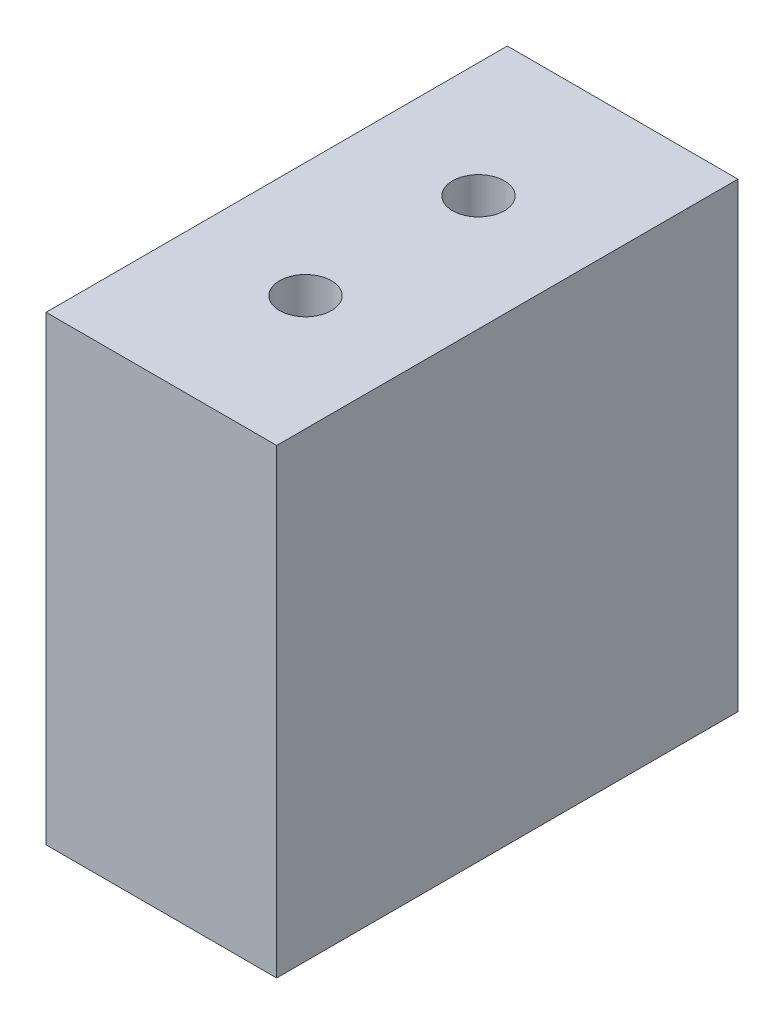
ISO-10303-21;
HEADER;
FILE_DESCRIPTION(('STEP AP214'),'2;1');
FILE_NAME('part.step','',(''),(''),'','','');
FILE_SCHEMA(('AUTOMOTIVE_DESIGN { 1 0 10303 214 1 1 1 1 }'));
ENDSEC;
DATA;
#1=APPLICATION_CONTEXT('core data for automotive mechanical design processes');
#2=APPLICATION_PROTOCOL_DEFINITION('international standard','automotive_design',2000,#1);
#3=PRODUCT_CONTEXT('',#1,'mechanical');
#4=PRODUCT('Part','Part','',(#3));
#5=PRODUCT_RELATED_PRODUCT_CATEGORY('part','',(#4));
#6=PRODUCT_DEFINITION_FORMATION('','',#4);
#7=PRODUCT_DEFINITION_CONTEXT('part definition',#1,'design');
#8=PRODUCT_DEFINITION('design','',#6,#7);
#9=PRODUCT_DEFINITION_SHAPE('','',#8);
#10=(LENGTH_UNIT() NAMED_UNIT(*) SI_UNIT(.MILLI.,.METRE.));
#11=(NAMED_UNIT(*) PLANE_ANGLE_UNIT() SI_UNIT($,.RADIAN.));
#12=(NAMED_UNIT(*) SI_UNIT($,.STERADIAN.) SOLID_ANGLE_UNIT());
#13=UNCERTAINTY_MEASURE_WITH_UNIT(LENGTH_MEASURE(1.E-05),#10,'distance_accuracy_value','');
#14=(GEOMETRIC_REPRESENTATION_CONTEXT(3) GLOBAL_UNCERTAINTY_ASSIGNED_CONTEXT((#13)) GLOBAL_UNIT_ASSIGNED_CONTEXT((#10,
#11,#12)) REPRESENTATION_CONTEXT('',''));
#15=CARTESIAN_POINT('',(0.,0.,0.));
#16=DIRECTION('',(0.,0.,1.));
#17=DIRECTION('',(1.,0.,0.));
#18=AXIS2_PLACEMENT_3D('',#15,#16,#17);
#19=CARTESIAN_POINT('',(20.,0.,0.));
#20=DIRECTION('',(0.,0.,1.));
#21=DIRECTION('',(1.,0.,0.));
#22=AXIS2_PLACEMENT_3D('',#19,#20,#21);
#23=PLANE('',#22);
#24=DIRECTION('',(0.,1.,0.));
#25=VECTOR('',#24,1.);
#26=CARTESIAN_POINT('',(0.,0.,0.));
#27=LINE('',#26,#25);
#28=CARTESIAN_POINT('',(0.,0.,0.));
#29=VERTEX_POINT('',#28);
#30=CARTESIAN_POINT('',(0.,40.,0.));
#31=VERTEX_POINT('',#30);
#32=EDGE_CURVE('E115',#29,#31,#27,.T.);
#33=ORIENTED_EDGE('',*,*,#32,.F.);
#34=DIRECTION('',(-1.,0.,0.));
#35=VECTOR('',#34,1.);
#36=CARTESIAN_POINT('',(20.,0.,0.));
#37=LINE('',#36,#35);
#38=CARTESIAN_POINT('',(20.,0.,0.));
#39=VERTEX_POINT('',#38);
#40=EDGE_CURVE('E11',#39,#29,#37,.T.);
#41=ORIENTED_EDGE('',*,*,#40,.F.);
#42=DIRECTION('',(0.,1.,0.));
#43=VECTOR('',#42,1.);
#44=CARTESIAN_POINT('',(20.,0.,0.));
#45=LINE('',#44,#43);
#46=CARTESIAN_POINT('',(20.,40.,0.));
#47=VERTEX_POINT('',#46);
#48=EDGE_CURVE('E107',#39,#47,#45,.T.);
#49=ORIENTED_EDGE('',*,*,#48,.T.);
#50=DIRECTION('',(-1.,0.,0.));
#51=VECTOR('',#50,1.);
#52=CARTESIAN_POINT('',(20.,40.,0.));
#53=LINE('',#52,#51);
#54=EDGE_CURVE('E46',#47,#31,#53,.T.);
#55=ORIENTED_EDGE('',*,*,#54,.T.);
#56=EDGE_LOOP('',(#33,#41,#49,#55));
#57=FACE_BOUND('',#56,.T.);
#58=ADVANCED_FACE('F43',(#57),#23,.T.);
#59=CARTESIAN_POINT('',(20.,0.,0.));
#60=DIRECTION('',(0.,1.,0.));
#61=DIRECTION('',(0.,0.,1.));
#62=AXIS2_PLACEMENT_3D('',#59,#60,#61);
#63=PLANE('',#62);
#64=CARTESIAN_POINT('',(10.,0.,-27.5));
#65=DIRECTION('',(0.,1.,0.));
#66=DIRECTION('',(0.,0.,1.));
#67=AXIS2_PLACEMENT_3D('',#64,#65,#66);
#68=CIRCLE('',#67,2.25);
#69=CARTESIAN_POINT('',(10.,0.,-25.25));
#70=VERTEX_POINT('',#69);
#71=EDGE_CURVE('E120',#70,#70,#68,.T.);
#72=ORIENTED_EDGE('',*,*,#71,.T.);
#73=EDGE_LOOP('',(#72));
#74=FACE_BOUND('',#73,.T.);
#75=CARTESIAN_POINT('',(10.,0.,-12.5));
#76=DIRECTION('',(0.,1.,0.));
#77=DIRECTION('',(0.,0.,1.));
#78=AXIS2_PLACEMENT_3D('',#75,#76,#77);
#79=CIRCLE('',#78,2.25);
#80=CARTESIAN_POINT('',(10.,0.,-10.25));
#81=VERTEX_POINT('',#80);
#82=EDGE_CURVE('E160',#81,#81,#79,.T.);
#83=ORIENTED_EDGE('',*,*,#82,.T.);
#84=EDGE_LOOP('',(#83));
#85=FACE_BOUND('',#84,.T.);
#86=DIRECTION('',(0.,0.,-1.));
#87=VECTOR('',#86,1.);
#88=CARTESIAN_POINT('',(0.,0.,0.));
#89=LINE('',#88,#87);
#90=CARTESIAN_POINT('',(0.,0.,-40.));
#91=VERTEX_POINT('',#90);
#92=EDGE_CURVE('E77',#29,#91,#89,.T.);
#93=ORIENTED_EDGE('',*,*,#92,.T.);
#94=DIRECTION('',(-1.,0.,0.));
#95=VECTOR('',#94,1.);
#96=CARTESIAN_POINT('',(20.,0.,-40.));
#97=LINE('',#96,#95);
#98=CARTESIAN_POINT('',(20.,0.,-40.));
#99=VERTEX_POINT('',#98);
#100=EDGE_CURVE('E53',#99,#91,#97,.T.);
#101=ORIENTED_EDGE('',*,*,#100,.F.);
#102=DIRECTION('',(0.,0.,-1.));
#103=VECTOR('',#102,1.);
#104=CARTESIAN_POINT('',(20.,0.,0.));
#105=LINE('',#104,#103);
#106=EDGE_CURVE('E94',#39,#99,#105,.T.);
#107=ORIENTED_EDGE('',*,*,#106,.F.);
#108=ORIENTED_EDGE('',*,*,#40,.T.);
#109=EDGE_LOOP('',(#93,#101,#107,#108));
#110=FACE_BOUND('',#109,.T.);
#111=ADVANCED_FACE('F132',(#74,#85,#110),#63,.F.);
#112=CARTESIAN_POINT('',(20.,0.,-40.));
#113=DIRECTION('',(0.,0.,1.));
#114=DIRECTION('',(1.,0.,0.));
#115=AXIS2_PLACEMENT_3D('',#112,#113,#114);
#116=PLANE('',#115);
#117=DIRECTION('',(0.,1.,0.));
#118=VECTOR('',#117,1.);
#119=CARTESIAN_POINT('',(0.,0.,-40.));
#120=LINE('',#119,#118);
#121=CARTESIAN_POINT('',(0.,40.,-40.));
#122=VERTEX_POINT('',#121);
#123=EDGE_CURVE('E102',#91,#122,#120,.T.);
#124=ORIENTED_EDGE('',*,*,#123,.T.);
#125=DIRECTION('',(-1.,0.,0.));
#126=VECTOR('',#125,1.);
#127=CARTESIAN_POINT('',(20.,40.,-40.));
#128=LINE('',#127,#126);
#129=CARTESIAN_POINT('',(20.,40.,-40.));
#130=VERTEX_POINT('',#129);
#131=EDGE_CURVE('E99',#130,#122,#128,.T.);
#132=ORIENTED_EDGE('',*,*,#131,.F.);
#133=DIRECTION('',(0.,1.,0.));
#134=VECTOR('',#133,1.);
#135=CARTESIAN_POINT('',(20.,0.,-40.));
#136=LINE('',#135,#134);
#137=EDGE_CURVE('E89',#99,#130,#136,.T.);
#138=ORIENTED_EDGE('',*,*,#137,.F.);
#139=ORIENTED_EDGE('',*,*,#100,.T.);
#140=EDGE_LOOP('',(#124,#132,#138,#139));
#141=FACE_BOUND('',#140,.T.);
#142=ADVANCED_FACE('F100',(#141),#116,.F.);
#143=CARTESIAN_POINT('',(20.,40.,0.));
#144=DIRECTION('',(0.,1.,0.));
#145=DIRECTION('',(0.,0.,1.));
#146=AXIS2_PLACEMENT_3D('',#143,#144,#145);
#147=PLANE('',#146);
#148=CARTESIAN_POINT('',(10.,40.,-27.5));
#149=DIRECTION('',(0.,1.,0.));
#150=DIRECTION('',(0.,0.,1.));
#151=AXIS2_PLACEMENT_3D('',#148,#149,#150);
#152=CIRCLE('',#151,2.25);
#153=CARTESIAN_POINT('',(10.,40.,-25.25));
#154=VERTEX_POINT('',#153);
#155=EDGE_CURVE('E154',#154,#154,#152,.T.);
#156=ORIENTED_EDGE('',*,*,#155,.F.);
#157=EDGE_LOOP('',(#156));
#158=FACE_BOUND('',#157,.T.);
#159=CARTESIAN_POINT('',(10.,40.,-12.5));
#160=DIRECTION('',(0.,1.,0.));
#161=DIRECTION('',(0.,0.,1.));
#162=AXIS2_PLACEMENT_3D('',#159,#160,#161);
#163=CIRCLE('',#162,2.25);
#164=CARTESIAN_POINT('',(10.,40.,-10.25));
#165=VERTEX_POINT('',#164);
#166=EDGE_CURVE('E157',#165,#165,#163,.T.);
#167=ORIENTED_EDGE('',*,*,#166,.F.);
#168=EDGE_LOOP('',(#167));
#169=FACE_BOUND('',#168,.T.);
#170=DIRECTION('',(0.,0.,-1.));
#171=VECTOR('',#170,1.);
#172=CARTESIAN_POINT('',(0.,40.,0.));
#173=LINE('',#172,#171);
#174=EDGE_CURVE('E119',#31,#122,#173,.T.);
#175=ORIENTED_EDGE('',*,*,#174,.F.);
#176=ORIENTED_EDGE('',*,*,#54,.F.);
#177=DIRECTION('',(0.,0.,-1.));
#178=VECTOR('',#177,1.);
#179=CARTESIAN_POINT('',(20.,40.,0.));
#180=LINE('',#179,#178);
#181=EDGE_CURVE('E93',#47,#130,#180,.T.);
#182=ORIENTED_EDGE('',*,*,#181,.T.);
#183=ORIENTED_EDGE('',*,*,#131,.T.);
#184=EDGE_LOOP('',(#175,#176,#182,#183));
#185=FACE_BOUND('',#184,.T.);
#186=ADVANCED_FACE('F105',(#158,#169,#185),#147,.T.);
#187=CARTESIAN_POINT('',(20.,0.,0.));
#188=DIRECTION('',(-1.,0.,0.));
#189=DIRECTION('',(0.,0.,1.));
#190=AXIS2_PLACEMENT_3D('',#187,#188,#189);
#191=PLANE('',#190);
#192=ORIENTED_EDGE('',*,*,#48,.F.);
#193=ORIENTED_EDGE('',*,*,#106,.T.);
#194=ORIENTED_EDGE('',*,*,#137,.T.);
#195=ORIENTED_EDGE('',*,*,#181,.F.);
#196=EDGE_LOOP('',(#192,#193,#194,#195));
#197=FACE_BOUND('',#196,.T.);
#198=ADVANCED_FACE('F92',(#197),#191,.F.);
#199=CARTESIAN_POINT('',(0.,0.,0.));
#200=DIRECTION('',(-1.,0.,0.));
#201=DIRECTION('',(0.,0.,1.));
#202=AXIS2_PLACEMENT_3D('',#199,#200,#201);
#203=PLANE('',#202);
#204=ORIENTED_EDGE('',*,*,#32,.T.);
#205=ORIENTED_EDGE('',*,*,#174,.T.);
#206=ORIENTED_EDGE('',*,*,#123,.F.);
#207=ORIENTED_EDGE('',*,*,#92,.F.);
#208=EDGE_LOOP('',(#204,#205,#206,#207));
#209=FACE_BOUND('',#208,.T.);
#210=ADVANCED_FACE('F129',(#209),#203,.T.);
#211=CARTESIAN_POINT('',(10.,0.,-12.5));
#212=DIRECTION('',(0.,1.,0.));
#213=DIRECTION('',(0.,0.,1.));
#214=AXIS2_PLACEMENT_3D('',#211,#212,#213);
#215=CYLINDRICAL_SURFACE('',#214,2.25);
#216=ORIENTED_EDGE('',*,*,#82,.F.);
#217=EDGE_LOOP('',(#216));
#218=FACE_BOUND('',#217,.T.);
#219=ORIENTED_EDGE('',*,*,#166,.T.);
#220=EDGE_LOOP('',(#219));
#221=FACE_BOUND('',#220,.T.);
#222=ADVANCED_FACE('F173',(#218,#221),#215,.F.);
#223=CARTESIAN_POINT('',(10.,0.,-27.5));
#224=DIRECTION('',(0.,1.,0.));
#225=DIRECTION('',(0.,0.,1.));
#226=AXIS2_PLACEMENT_3D('',#223,#224,#225);
#227=CYLINDRICAL_SURFACE('',#226,2.25);
#228=ORIENTED_EDGE('',*,*,#71,.F.);
#229=EDGE_LOOP('',(#228));
#230=FACE_BOUND('',#229,.T.);
#231=ORIENTED_EDGE('',*,*,#155,.T.);
#232=EDGE_LOOP('',(#231));
#233=FACE_BOUND('',#232,.T.);
#234=ADVANCED_FACE('F170',(#230,#233),#227,.F.);
#235=CLOSED_SHELL('',(#58,#111,#142,#186,#198,#210,#222,#234));
#236=MANIFOLD_SOLID_BREP('B2',#235);
#237=ADVANCED_BREP_SHAPE_REPRESENTATION('',(#18,#236),#14);
#238=SHAPE_DEFINITION_REPRESENTATION(#9,#237);
ENDSEC;
END-ISO-10303-21;
